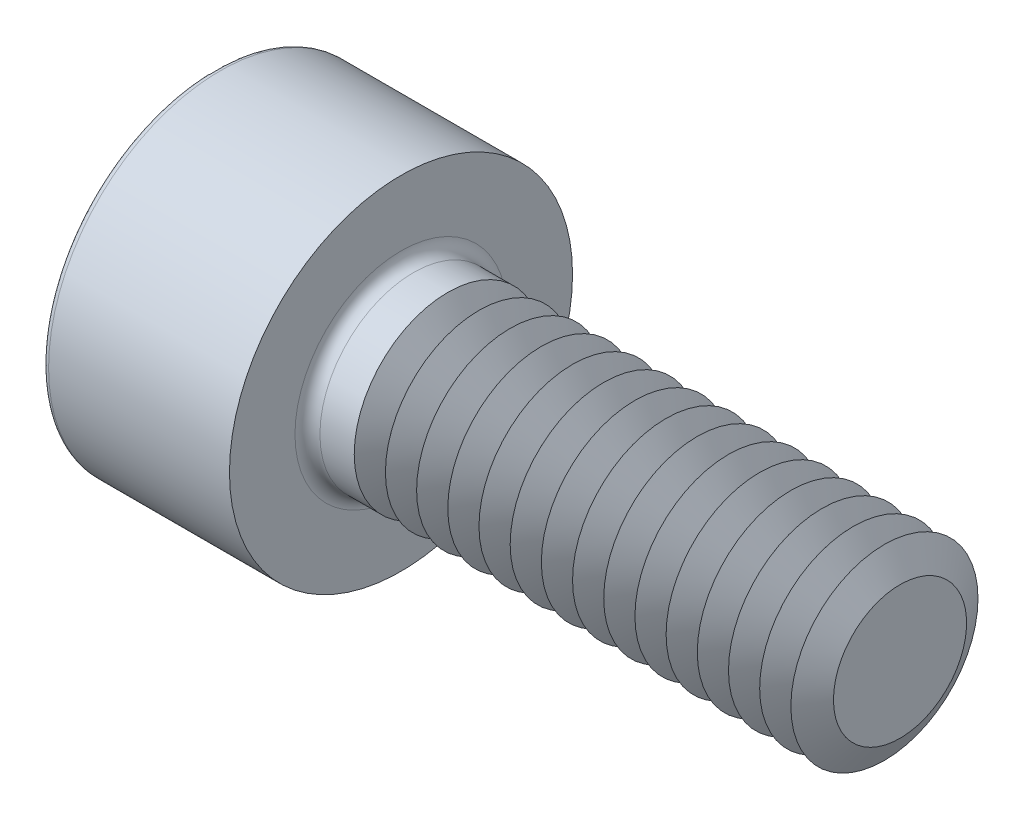
ISO-10303-21;
HEADER;
FILE_DESCRIPTION(('STEP AP214'),'2;1');
FILE_NAME('part.step','',(''),(''),'','','');
FILE_SCHEMA(('AUTOMOTIVE_DESIGN { 1 0 10303 214 1 1 1 1 }'));
ENDSEC;
DATA;
#1=APPLICATION_CONTEXT('core data for automotive mechanical design processes');
#2=APPLICATION_PROTOCOL_DEFINITION('international standard','automotive_design',2000,#1);
#3=PRODUCT_CONTEXT('',#1,'mechanical');
#4=PRODUCT('Part','Part','',(#3));
#5=PRODUCT_RELATED_PRODUCT_CATEGORY('part','',(#4));
#6=PRODUCT_DEFINITION_FORMATION('','',#4);
#7=PRODUCT_DEFINITION_CONTEXT('part definition',#1,'design');
#8=PRODUCT_DEFINITION('design','',#6,#7);
#9=PRODUCT_DEFINITION_SHAPE('','',#8);
#10=(LENGTH_UNIT() NAMED_UNIT(*) SI_UNIT(.MILLI.,.METRE.));
#11=(NAMED_UNIT(*) PLANE_ANGLE_UNIT() SI_UNIT($,.RADIAN.));
#12=(NAMED_UNIT(*) SI_UNIT($,.STERADIAN.) SOLID_ANGLE_UNIT());
#13=UNCERTAINTY_MEASURE_WITH_UNIT(LENGTH_MEASURE(1.E-05),#10,'distance_accuracy_value','');
#14=(GEOMETRIC_REPRESENTATION_CONTEXT(3) GLOBAL_UNCERTAINTY_ASSIGNED_CONTEXT((#13)) GLOBAL_UNIT_ASSIGNED_CONTEXT((#10,
#11,#12)) REPRESENTATION_CONTEXT('',''));
#15=CARTESIAN_POINT('',(0.,0.,0.));
#16=DIRECTION('',(0.,0.,1.));
#17=DIRECTION('',(1.,0.,0.));
#18=AXIS2_PLACEMENT_3D('',#15,#16,#17);
#19=CARTESIAN_POINT('',(0.,0.,0.));
#20=DIRECTION('',(-1.,0.,0.));
#21=DIRECTION('',(0.,0.,1.));
#22=AXIS2_PLACEMENT_3D('',#19,#20,#21);
#23=CYLINDRICAL_SURFACE('',#22,1.5);
#24=CARTESIAN_POINT('',(4.25000733344089,0.,0.));
#25=DIRECTION('',(-1.,0.,0.));
#26=DIRECTION('',(0.,0.,1.));
#27=AXIS2_PLACEMENT_3D('',#24,#25,#26);
#28=CIRCLE('',#27,1.5);
#29=CARTESIAN_POINT('',(4.25000733344089,0.,1.5));
#30=VERTEX_POINT('',#29);
#31=EDGE_CURVE('E347',#30,#30,#28,.T.);
#32=ORIENTED_EDGE('',*,*,#31,.T.);
#33=EDGE_LOOP('',(#32));
#34=FACE_BOUND('',#33,.T.);
#35=CARTESIAN_POINT('',(4.24999266655911,0.,0.));
#36=DIRECTION('',(-1.,0.,0.));
#37=DIRECTION('',(0.,0.,1.));
#38=AXIS2_PLACEMENT_3D('',#35,#36,#37);
#39=CIRCLE('',#38,1.5);
#40=CARTESIAN_POINT('',(4.24999266655911,0.,1.5));
#41=VERTEX_POINT('',#40);
#42=EDGE_CURVE('E343',#41,#41,#39,.T.);
#43=ORIENTED_EDGE('',*,*,#42,.F.);
#44=EDGE_LOOP('',(#43));
#45=FACE_BOUND('',#44,.T.);
#46=ADVANCED_FACE('F38',(#34,#45),#23,.T.);
#47=CARTESIAN_POINT('',(4.75000733344089,0.,0.));
#48=DIRECTION('',(-1.,0.,0.));
#49=DIRECTION('',(0.,0.,1.));
#50=AXIS2_PLACEMENT_3D('',#47,#48,#49);
#51=CIRCLE('',#50,1.5);
#52=CARTESIAN_POINT('',(4.75000733344089,0.,1.5));
#53=VERTEX_POINT('',#52);
#54=EDGE_CURVE('E360',#53,#53,#51,.T.);
#55=ORIENTED_EDGE('',*,*,#54,.T.);
#56=EDGE_LOOP('',(#55));
#57=FACE_BOUND('',#56,.T.);
#58=CARTESIAN_POINT('',(4.74999266655911,0.,0.));
#59=DIRECTION('',(-1.,0.,0.));
#60=DIRECTION('',(0.,0.,1.));
#61=AXIS2_PLACEMENT_3D('',#58,#59,#60);
#62=CIRCLE('',#61,1.5);
#63=CARTESIAN_POINT('',(4.74999266655911,0.,1.5));
#64=VERTEX_POINT('',#63);
#65=EDGE_CURVE('E349',#64,#64,#62,.T.);
#66=ORIENTED_EDGE('',*,*,#65,.F.);
#67=EDGE_LOOP('',(#66));
#68=FACE_BOUND('',#67,.T.);
#69=ADVANCED_FACE('F173',(#57,#68),#23,.T.);
#70=CARTESIAN_POINT('',(5.25000733344089,0.,0.));
#71=DIRECTION('',(-1.,0.,0.));
#72=DIRECTION('',(0.,0.,1.));
#73=AXIS2_PLACEMENT_3D('',#70,#71,#72);
#74=CIRCLE('',#73,1.5);
#75=CARTESIAN_POINT('',(5.25000733344089,0.,1.5));
#76=VERTEX_POINT('',#75);
#77=EDGE_CURVE('E369',#76,#76,#74,.T.);
#78=ORIENTED_EDGE('',*,*,#77,.T.);
#79=EDGE_LOOP('',(#78));
#80=FACE_BOUND('',#79,.T.);
#81=CARTESIAN_POINT('',(5.24999266655911,0.,0.));
#82=DIRECTION('',(-1.,0.,0.));
#83=DIRECTION('',(0.,0.,1.));
#84=AXIS2_PLACEMENT_3D('',#81,#82,#83);
#85=CIRCLE('',#84,1.5);
#86=CARTESIAN_POINT('',(5.24999266655911,0.,1.5));
#87=VERTEX_POINT('',#86);
#88=EDGE_CURVE('E363',#87,#87,#85,.T.);
#89=ORIENTED_EDGE('',*,*,#88,.F.);
#90=EDGE_LOOP('',(#89));
#91=FACE_BOUND('',#90,.T.);
#92=ADVANCED_FACE('F178',(#80,#91),#23,.T.);
#93=CARTESIAN_POINT('',(5.75000733344089,0.,0.));
#94=DIRECTION('',(-1.,0.,0.));
#95=DIRECTION('',(0.,0.,1.));
#96=AXIS2_PLACEMENT_3D('',#93,#94,#95);
#97=CIRCLE('',#96,1.5);
#98=CARTESIAN_POINT('',(5.75000733344089,0.,1.5));
#99=VERTEX_POINT('',#98);
#100=EDGE_CURVE('E378',#99,#99,#97,.T.);
#101=ORIENTED_EDGE('',*,*,#100,.T.);
#102=EDGE_LOOP('',(#101));
#103=FACE_BOUND('',#102,.T.);
#104=CARTESIAN_POINT('',(5.74999266655911,0.,0.));
#105=DIRECTION('',(-1.,0.,0.));
#106=DIRECTION('',(0.,0.,1.));
#107=AXIS2_PLACEMENT_3D('',#104,#105,#106);
#108=CIRCLE('',#107,1.5);
#109=CARTESIAN_POINT('',(5.74999266655911,0.,1.5));
#110=VERTEX_POINT('',#109);
#111=EDGE_CURVE('E372',#110,#110,#108,.T.);
#112=ORIENTED_EDGE('',*,*,#111,.F.);
#113=EDGE_LOOP('',(#112));
#114=FACE_BOUND('',#113,.T.);
#115=ADVANCED_FACE('F763',(#103,#114),#23,.T.);
#116=CARTESIAN_POINT('',(6.25000733344089,0.,0.));
#117=DIRECTION('',(-1.,0.,0.));
#118=DIRECTION('',(0.,0.,1.));
#119=AXIS2_PLACEMENT_3D('',#116,#117,#118);
#120=CIRCLE('',#119,1.5);
#121=CARTESIAN_POINT('',(6.25000733344089,0.,1.5));
#122=VERTEX_POINT('',#121);
#123=EDGE_CURVE('E387',#122,#122,#120,.T.);
#124=ORIENTED_EDGE('',*,*,#123,.T.);
#125=EDGE_LOOP('',(#124));
#126=FACE_BOUND('',#125,.T.);
#127=CARTESIAN_POINT('',(6.24999266655911,0.,0.));
#128=DIRECTION('',(-1.,0.,0.));
#129=DIRECTION('',(0.,0.,1.));
#130=AXIS2_PLACEMENT_3D('',#127,#128,#129);
#131=CIRCLE('',#130,1.5);
#132=CARTESIAN_POINT('',(6.24999266655911,0.,1.5));
#133=VERTEX_POINT('',#132);
#134=EDGE_CURVE('E381',#133,#133,#131,.T.);
#135=ORIENTED_EDGE('',*,*,#134,.F.);
#136=EDGE_LOOP('',(#135));
#137=FACE_BOUND('',#136,.T.);
#138=ADVANCED_FACE('F755',(#126,#137),#23,.T.);
#139=CARTESIAN_POINT('',(6.75000733344089,0.,0.));
#140=DIRECTION('',(-1.,0.,0.));
#141=DIRECTION('',(0.,0.,1.));
#142=AXIS2_PLACEMENT_3D('',#139,#140,#141);
#143=CIRCLE('',#142,1.5);
#144=CARTESIAN_POINT('',(6.75000733344089,0.,1.5));
#145=VERTEX_POINT('',#144);
#146=EDGE_CURVE('E396',#145,#145,#143,.T.);
#147=ORIENTED_EDGE('',*,*,#146,.T.);
#148=EDGE_LOOP('',(#147));
#149=FACE_BOUND('',#148,.T.);
#150=CARTESIAN_POINT('',(6.74999266655911,0.,0.));
#151=DIRECTION('',(-1.,0.,0.));
#152=DIRECTION('',(0.,0.,1.));
#153=AXIS2_PLACEMENT_3D('',#150,#151,#152);
#154=CIRCLE('',#153,1.5);
#155=CARTESIAN_POINT('',(6.74999266655911,0.,1.5));
#156=VERTEX_POINT('',#155);
#157=EDGE_CURVE('E390',#156,#156,#154,.T.);
#158=ORIENTED_EDGE('',*,*,#157,.F.);
#159=EDGE_LOOP('',(#158));
#160=FACE_BOUND('',#159,.T.);
#161=ADVANCED_FACE('F747',(#149,#160),#23,.T.);
#162=CARTESIAN_POINT('',(7.25000733344089,0.,0.));
#163=DIRECTION('',(-1.,0.,0.));
#164=DIRECTION('',(0.,0.,1.));
#165=AXIS2_PLACEMENT_3D('',#162,#163,#164);
#166=CIRCLE('',#165,1.5);
#167=CARTESIAN_POINT('',(7.25000733344089,0.,1.5));
#168=VERTEX_POINT('',#167);
#169=EDGE_CURVE('E405',#168,#168,#166,.T.);
#170=ORIENTED_EDGE('',*,*,#169,.T.);
#171=EDGE_LOOP('',(#170));
#172=FACE_BOUND('',#171,.T.);
#173=CARTESIAN_POINT('',(7.24999266655911,0.,0.));
#174=DIRECTION('',(-1.,0.,0.));
#175=DIRECTION('',(0.,0.,1.));
#176=AXIS2_PLACEMENT_3D('',#173,#174,#175);
#177=CIRCLE('',#176,1.5);
#178=CARTESIAN_POINT('',(7.24999266655911,0.,1.5));
#179=VERTEX_POINT('',#178);
#180=EDGE_CURVE('E399',#179,#179,#177,.T.);
#181=ORIENTED_EDGE('',*,*,#180,.F.);
#182=EDGE_LOOP('',(#181));
#183=FACE_BOUND('',#182,.T.);
#184=ADVANCED_FACE('F739',(#172,#183),#23,.T.);
#185=CARTESIAN_POINT('',(7.75000733344089,0.,0.));
#186=DIRECTION('',(-1.,0.,0.));
#187=DIRECTION('',(0.,0.,1.));
#188=AXIS2_PLACEMENT_3D('',#185,#186,#187);
#189=CIRCLE('',#188,1.5);
#190=CARTESIAN_POINT('',(7.75000733344089,0.,1.5));
#191=VERTEX_POINT('',#190);
#192=EDGE_CURVE('E414',#191,#191,#189,.T.);
#193=ORIENTED_EDGE('',*,*,#192,.T.);
#194=EDGE_LOOP('',(#193));
#195=FACE_BOUND('',#194,.T.);
#196=CARTESIAN_POINT('',(7.74999266655911,0.,0.));
#197=DIRECTION('',(-1.,0.,0.));
#198=DIRECTION('',(0.,0.,1.));
#199=AXIS2_PLACEMENT_3D('',#196,#197,#198);
#200=CIRCLE('',#199,1.5);
#201=CARTESIAN_POINT('',(7.74999266655911,0.,1.5));
#202=VERTEX_POINT('',#201);
#203=EDGE_CURVE('E408',#202,#202,#200,.T.);
#204=ORIENTED_EDGE('',*,*,#203,.F.);
#205=EDGE_LOOP('',(#204));
#206=FACE_BOUND('',#205,.T.);
#207=ADVANCED_FACE('F731',(#195,#206),#23,.T.);
#208=CARTESIAN_POINT('',(8.25000733344089,0.,0.));
#209=DIRECTION('',(-1.,0.,0.));
#210=DIRECTION('',(0.,0.,1.));
#211=AXIS2_PLACEMENT_3D('',#208,#209,#210);
#212=CIRCLE('',#211,1.5);
#213=CARTESIAN_POINT('',(8.25000733344089,0.,1.5));
#214=VERTEX_POINT('',#213);
#215=EDGE_CURVE('E423',#214,#214,#212,.T.);
#216=ORIENTED_EDGE('',*,*,#215,.T.);
#217=EDGE_LOOP('',(#216));
#218=FACE_BOUND('',#217,.T.);
#219=CARTESIAN_POINT('',(8.24999266655911,0.,0.));
#220=DIRECTION('',(-1.,0.,0.));
#221=DIRECTION('',(0.,0.,1.));
#222=AXIS2_PLACEMENT_3D('',#219,#220,#221);
#223=CIRCLE('',#222,1.5);
#224=CARTESIAN_POINT('',(8.24999266655911,0.,1.5));
#225=VERTEX_POINT('',#224);
#226=EDGE_CURVE('E417',#225,#225,#223,.T.);
#227=ORIENTED_EDGE('',*,*,#226,.F.);
#228=EDGE_LOOP('',(#227));
#229=FACE_BOUND('',#228,.T.);
#230=ADVANCED_FACE('F723',(#218,#229),#23,.T.);
#231=CARTESIAN_POINT('',(8.75000733344089,0.,0.));
#232=DIRECTION('',(-1.,0.,0.));
#233=DIRECTION('',(0.,0.,1.));
#234=AXIS2_PLACEMENT_3D('',#231,#232,#233);
#235=CIRCLE('',#234,1.5);
#236=CARTESIAN_POINT('',(8.75000733344089,0.,1.5));
#237=VERTEX_POINT('',#236);
#238=EDGE_CURVE('E432',#237,#237,#235,.T.);
#239=ORIENTED_EDGE('',*,*,#238,.T.);
#240=EDGE_LOOP('',(#239));
#241=FACE_BOUND('',#240,.T.);
#242=CARTESIAN_POINT('',(8.74999266655911,0.,0.));
#243=DIRECTION('',(-1.,0.,0.));
#244=DIRECTION('',(0.,0.,1.));
#245=AXIS2_PLACEMENT_3D('',#242,#243,#244);
#246=CIRCLE('',#245,1.5);
#247=CARTESIAN_POINT('',(8.74999266655911,0.,1.5));
#248=VERTEX_POINT('',#247);
#249=EDGE_CURVE('E426',#248,#248,#246,.T.);
#250=ORIENTED_EDGE('',*,*,#249,.F.);
#251=EDGE_LOOP('',(#250));
#252=FACE_BOUND('',#251,.T.);
#253=ADVANCED_FACE('F715',(#241,#252),#23,.T.);
#254=CARTESIAN_POINT('',(9.25000733344089,0.,0.));
#255=DIRECTION('',(-1.,0.,0.));
#256=DIRECTION('',(0.,0.,1.));
#257=AXIS2_PLACEMENT_3D('',#254,#255,#256);
#258=CIRCLE('',#257,1.5);
#259=CARTESIAN_POINT('',(9.25000733344089,0.,1.5));
#260=VERTEX_POINT('',#259);
#261=EDGE_CURVE('E441',#260,#260,#258,.T.);
#262=ORIENTED_EDGE('',*,*,#261,.T.);
#263=EDGE_LOOP('',(#262));
#264=FACE_BOUND('',#263,.T.);
#265=CARTESIAN_POINT('',(9.24999266655911,0.,0.));
#266=DIRECTION('',(-1.,0.,0.));
#267=DIRECTION('',(0.,0.,1.));
#268=AXIS2_PLACEMENT_3D('',#265,#266,#267);
#269=CIRCLE('',#268,1.5);
#270=CARTESIAN_POINT('',(9.24999266655911,0.,1.5));
#271=VERTEX_POINT('',#270);
#272=EDGE_CURVE('E435',#271,#271,#269,.T.);
#273=ORIENTED_EDGE('',*,*,#272,.F.);
#274=EDGE_LOOP('',(#273));
#275=FACE_BOUND('',#274,.T.);
#276=ADVANCED_FACE('F706',(#264,#275),#23,.T.);
#277=CARTESIAN_POINT('',(9.75000733344089,0.,0.));
#278=DIRECTION('',(-1.,0.,0.));
#279=DIRECTION('',(0.,0.,1.));
#280=AXIS2_PLACEMENT_3D('',#277,#278,#279);
#281=CIRCLE('',#280,1.5);
#282=CARTESIAN_POINT('',(9.75000733344089,0.,1.5));
#283=VERTEX_POINT('',#282);
#284=EDGE_CURVE('E450',#283,#283,#281,.T.);
#285=ORIENTED_EDGE('',*,*,#284,.T.);
#286=EDGE_LOOP('',(#285));
#287=FACE_BOUND('',#286,.T.);
#288=CARTESIAN_POINT('',(9.74999266655911,0.,0.));
#289=DIRECTION('',(-1.,0.,0.));
#290=DIRECTION('',(0.,0.,1.));
#291=AXIS2_PLACEMENT_3D('',#288,#289,#290);
#292=CIRCLE('',#291,1.5);
#293=CARTESIAN_POINT('',(9.74999266655911,0.,1.5));
#294=VERTEX_POINT('',#293);
#295=EDGE_CURVE('E444',#294,#294,#292,.T.);
#296=ORIENTED_EDGE('',*,*,#295,.F.);
#297=EDGE_LOOP('',(#296));
#298=FACE_BOUND('',#297,.T.);
#299=ADVANCED_FACE('F239',(#287,#298),#23,.T.);
#300=CARTESIAN_POINT('',(9.75000733344089,0.,0.));
#301=DIRECTION('',(-1.,0.,0.));
#302=DIRECTION('',(0.,0.,1.));
#303=AXIS2_PLACEMENT_3D('',#300,#301,#302);
#304=CONICAL_SURFACE('',#303,1.5,1.0471975511966);
#305=CARTESIAN_POINT('',(10.,0.,0.));
#306=DIRECTION('',(-1.,0.,0.));
#307=DIRECTION('',(0.,0.,1.));
#308=AXIS2_PLACEMENT_3D('',#305,#306,#307);
#309=CIRCLE('',#308,1.067);
#310=CARTESIAN_POINT('',(10.,0.,1.067));
#311=VERTEX_POINT('',#310);
#312=EDGE_CURVE('E456',#311,#311,#309,.T.);
#313=ORIENTED_EDGE('',*,*,#312,.T.);
#314=EDGE_LOOP('',(#313));
#315=FACE_BOUND('',#314,.T.);
#316=ORIENTED_EDGE('',*,*,#284,.F.);
#317=EDGE_LOOP('',(#316));
#318=FACE_BOUND('',#317,.T.);
#319=ADVANCED_FACE('F235',(#315,#318),#304,.T.);
#320=CARTESIAN_POINT('',(10.,0.,0.));
#321=DIRECTION('',(1.,0.,0.));
#322=DIRECTION('',(0.,0.,-1.));
#323=AXIS2_PLACEMENT_3D('',#320,#321,#322);
#324=CONICAL_SURFACE('',#323,1.067,1.0471975511966);
#325=CARTESIAN_POINT('',(10.2499926665591,0.,0.));
#326=DIRECTION('',(-1.,0.,0.));
#327=DIRECTION('',(0.,0.,1.));
#328=AXIS2_PLACEMENT_3D('',#325,#326,#327);
#329=CIRCLE('',#328,1.5);
#330=CARTESIAN_POINT('',(10.2499926665591,0.,1.5));
#331=VERTEX_POINT('',#330);
#332=EDGE_CURVE('E453',#331,#331,#329,.T.);
#333=ORIENTED_EDGE('',*,*,#332,.T.);
#334=EDGE_LOOP('',(#333));
#335=FACE_BOUND('',#334,.T.);
#336=ORIENTED_EDGE('',*,*,#312,.F.);
#337=EDGE_LOOP('',(#336));
#338=FACE_BOUND('',#337,.T.);
#339=ADVANCED_FACE('F238',(#335,#338),#324,.T.);
#340=CARTESIAN_POINT('',(11.,1.5,0.));
#341=DIRECTION('',(-1.,0.,0.));
#342=DIRECTION('',(0.,0.,1.));
#343=AXIS2_PLACEMENT_3D('',#340,#341,#342);
#344=PLANE('',#343);
#345=CARTESIAN_POINT('',(11.,0.,0.));
#346=DIRECTION('',(-1.,0.,0.));
#347=DIRECTION('',(0.,0.,1.));
#348=AXIS2_PLACEMENT_3D('',#345,#346,#347);
#349=CIRCLE('',#348,1.067);
#350=CARTESIAN_POINT('',(11.,0.,1.067));
#351=VERTEX_POINT('',#350);
#352=EDGE_CURVE('E128',#351,#351,#349,.T.);
#353=ORIENTED_EDGE('',*,*,#352,.F.);
#354=EDGE_LOOP('',(#353));
#355=FACE_BOUND('',#354,.T.);
#356=ADVANCED_FACE('F184',(#355),#344,.F.);
#357=CARTESIAN_POINT('',(10.7500073334409,0.,0.));
#358=DIRECTION('',(-1.,0.,0.));
#359=DIRECTION('',(0.,0.,1.));
#360=AXIS2_PLACEMENT_3D('',#357,#358,#359);
#361=CONICAL_SURFACE('',#360,1.5,1.0471975511966);
#362=ORIENTED_EDGE('',*,*,#352,.T.);
#363=EDGE_LOOP('',(#362));
#364=FACE_BOUND('',#363,.T.);
#365=CARTESIAN_POINT('',(10.7500073334409,0.,0.));
#366=DIRECTION('',(-1.,0.,0.));
#367=DIRECTION('',(0.,0.,1.));
#368=AXIS2_PLACEMENT_3D('',#365,#366,#367);
#369=CIRCLE('',#368,1.5);
#370=CARTESIAN_POINT('',(10.7500073334409,0.,1.5));
#371=VERTEX_POINT('',#370);
#372=EDGE_CURVE('E468',#371,#371,#369,.T.);
#373=ORIENTED_EDGE('',*,*,#372,.F.);
#374=EDGE_LOOP('',(#373));
#375=FACE_BOUND('',#374,.T.);
#376=ADVANCED_FACE('F222',(#364,#375),#361,.T.);
#377=ORIENTED_EDGE('',*,*,#372,.T.);
#378=EDGE_LOOP('',(#377));
#379=FACE_BOUND('',#378,.T.);
#380=CARTESIAN_POINT('',(10.7499926665591,0.,0.));
#381=DIRECTION('',(-1.,0.,0.));
#382=DIRECTION('',(0.,0.,1.));
#383=AXIS2_PLACEMENT_3D('',#380,#381,#382);
#384=CIRCLE('',#383,1.5);
#385=CARTESIAN_POINT('',(10.7499926665591,0.,1.5));
#386=VERTEX_POINT('',#385);
#387=EDGE_CURVE('E462',#386,#386,#384,.T.);
#388=ORIENTED_EDGE('',*,*,#387,.F.);
#389=EDGE_LOOP('',(#388));
#390=FACE_BOUND('',#389,.T.);
#391=ADVANCED_FACE('F170',(#379,#390),#23,.T.);
#392=CARTESIAN_POINT('',(10.5,0.,0.));
#393=DIRECTION('',(1.,0.,0.));
#394=DIRECTION('',(0.,0.,-1.));
#395=AXIS2_PLACEMENT_3D('',#392,#393,#394);
#396=CONICAL_SURFACE('',#395,1.067,1.0471975511966);
#397=ORIENTED_EDGE('',*,*,#387,.T.);
#398=EDGE_LOOP('',(#397));
#399=FACE_BOUND('',#398,.T.);
#400=CARTESIAN_POINT('',(10.5,0.,0.));
#401=DIRECTION('',(-1.,0.,0.));
#402=DIRECTION('',(0.,0.,1.));
#403=AXIS2_PLACEMENT_3D('',#400,#401,#402);
#404=CIRCLE('',#403,1.067);
#405=CARTESIAN_POINT('',(10.5,0.,1.067));
#406=VERTEX_POINT('',#405);
#407=EDGE_CURVE('E465',#406,#406,#404,.T.);
#408=ORIENTED_EDGE('',*,*,#407,.F.);
#409=EDGE_LOOP('',(#408));
#410=FACE_BOUND('',#409,.T.);
#411=ADVANCED_FACE('F230',(#399,#410),#396,.T.);
#412=CARTESIAN_POINT('',(10.2500073334409,0.,0.));
#413=DIRECTION('',(-1.,0.,0.));
#414=DIRECTION('',(0.,0.,1.));
#415=AXIS2_PLACEMENT_3D('',#412,#413,#414);
#416=CONICAL_SURFACE('',#415,1.5,1.0471975511966);
#417=ORIENTED_EDGE('',*,*,#407,.T.);
#418=EDGE_LOOP('',(#417));
#419=FACE_BOUND('',#418,.T.);
#420=CARTESIAN_POINT('',(10.2500073334409,0.,0.));
#421=DIRECTION('',(-1.,0.,0.));
#422=DIRECTION('',(0.,0.,1.));
#423=AXIS2_PLACEMENT_3D('',#420,#421,#422);
#424=CIRCLE('',#423,1.5);
#425=CARTESIAN_POINT('',(10.2500073334409,0.,1.5));
#426=VERTEX_POINT('',#425);
#427=EDGE_CURVE('E459',#426,#426,#424,.T.);
#428=ORIENTED_EDGE('',*,*,#427,.F.);
#429=EDGE_LOOP('',(#428));
#430=FACE_BOUND('',#429,.T.);
#431=ADVANCED_FACE('F226',(#419,#430),#416,.T.);
#432=ORIENTED_EDGE('',*,*,#427,.T.);
#433=EDGE_LOOP('',(#432));
#434=FACE_BOUND('',#433,.T.);
#435=ORIENTED_EDGE('',*,*,#332,.F.);
#436=EDGE_LOOP('',(#435));
#437=FACE_BOUND('',#436,.T.);
#438=ADVANCED_FACE('F229',(#434,#437),#23,.T.);
#439=CARTESIAN_POINT('',(9.25000733344089,0.,0.));
#440=DIRECTION('',(-1.,0.,0.));
#441=DIRECTION('',(0.,0.,1.));
#442=AXIS2_PLACEMENT_3D('',#439,#440,#441);
#443=CONICAL_SURFACE('',#442,1.5,1.0471975511966);
#444=CARTESIAN_POINT('',(9.5,0.,0.));
#445=DIRECTION('',(-1.,0.,0.));
#446=DIRECTION('',(0.,0.,1.));
#447=AXIS2_PLACEMENT_3D('',#444,#445,#446);
#448=CIRCLE('',#447,1.067);
#449=CARTESIAN_POINT('',(9.5,0.,1.067));
#450=VERTEX_POINT('',#449);
#451=EDGE_CURVE('E447',#450,#450,#448,.T.);
#452=ORIENTED_EDGE('',*,*,#451,.T.);
#453=EDGE_LOOP('',(#452));
#454=FACE_BOUND('',#453,.T.);
#455=ORIENTED_EDGE('',*,*,#261,.F.);
#456=EDGE_LOOP('',(#455));
#457=FACE_BOUND('',#456,.T.);
#458=ADVANCED_FACE('F244',(#454,#457),#443,.T.);
#459=CARTESIAN_POINT('',(9.5,0.,0.));
#460=DIRECTION('',(1.,0.,0.));
#461=DIRECTION('',(0.,0.,-1.));
#462=AXIS2_PLACEMENT_3D('',#459,#460,#461);
#463=CONICAL_SURFACE('',#462,1.067,1.0471975511966);
#464=ORIENTED_EDGE('',*,*,#295,.T.);
#465=EDGE_LOOP('',(#464));
#466=FACE_BOUND('',#465,.T.);
#467=ORIENTED_EDGE('',*,*,#451,.F.);
#468=EDGE_LOOP('',(#467));
#469=FACE_BOUND('',#468,.T.);
#470=ADVANCED_FACE('F247',(#466,#469),#463,.T.);
#471=CARTESIAN_POINT('',(8.75000733344089,0.,0.));
#472=DIRECTION('',(-1.,0.,0.));
#473=DIRECTION('',(0.,0.,1.));
#474=AXIS2_PLACEMENT_3D('',#471,#472,#473);
#475=CONICAL_SURFACE('',#474,1.5,1.0471975511966);
#476=CARTESIAN_POINT('',(9.,0.,0.));
#477=DIRECTION('',(-1.,0.,0.));
#478=DIRECTION('',(0.,0.,1.));
#479=AXIS2_PLACEMENT_3D('',#476,#477,#478);
#480=CIRCLE('',#479,1.067);
#481=CARTESIAN_POINT('',(9.,0.,1.067));
#482=VERTEX_POINT('',#481);
#483=EDGE_CURVE('E438',#482,#482,#480,.T.);
#484=ORIENTED_EDGE('',*,*,#483,.T.);
#485=EDGE_LOOP('',(#484));
#486=FACE_BOUND('',#485,.T.);
#487=ORIENTED_EDGE('',*,*,#238,.F.);
#488=EDGE_LOOP('',(#487));
#489=FACE_BOUND('',#488,.T.);
#490=ADVANCED_FACE('F251',(#486,#489),#475,.T.);
#491=CARTESIAN_POINT('',(9.,0.,0.));
#492=DIRECTION('',(1.,0.,0.));
#493=DIRECTION('',(0.,0.,-1.));
#494=AXIS2_PLACEMENT_3D('',#491,#492,#493);
#495=CONICAL_SURFACE('',#494,1.067,1.0471975511966);
#496=ORIENTED_EDGE('',*,*,#272,.T.);
#497=EDGE_LOOP('',(#496));
#498=FACE_BOUND('',#497,.T.);
#499=ORIENTED_EDGE('',*,*,#483,.F.);
#500=EDGE_LOOP('',(#499));
#501=FACE_BOUND('',#500,.T.);
#502=ADVANCED_FACE('F255',(#498,#501),#495,.T.);
#503=CARTESIAN_POINT('',(8.25000733344089,0.,0.));
#504=DIRECTION('',(-1.,0.,0.));
#505=DIRECTION('',(0.,0.,1.));
#506=AXIS2_PLACEMENT_3D('',#503,#504,#505);
#507=CONICAL_SURFACE('',#506,1.5,1.0471975511966);
#508=CARTESIAN_POINT('',(8.5,0.,0.));
#509=DIRECTION('',(-1.,0.,0.));
#510=DIRECTION('',(0.,0.,1.));
#511=AXIS2_PLACEMENT_3D('',#508,#509,#510);
#512=CIRCLE('',#511,1.067);
#513=CARTESIAN_POINT('',(8.5,0.,1.067));
#514=VERTEX_POINT('',#513);
#515=EDGE_CURVE('E429',#514,#514,#512,.T.);
#516=ORIENTED_EDGE('',*,*,#515,.T.);
#517=EDGE_LOOP('',(#516));
#518=FACE_BOUND('',#517,.T.);
#519=ORIENTED_EDGE('',*,*,#215,.F.);
#520=EDGE_LOOP('',(#519));
#521=FACE_BOUND('',#520,.T.);
#522=ADVANCED_FACE('F259',(#518,#521),#507,.T.);
#523=CARTESIAN_POINT('',(8.5,0.,0.));
#524=DIRECTION('',(1.,0.,0.));
#525=DIRECTION('',(0.,0.,-1.));
#526=AXIS2_PLACEMENT_3D('',#523,#524,#525);
#527=CONICAL_SURFACE('',#526,1.067,1.0471975511966);
#528=ORIENTED_EDGE('',*,*,#249,.T.);
#529=EDGE_LOOP('',(#528));
#530=FACE_BOUND('',#529,.T.);
#531=ORIENTED_EDGE('',*,*,#515,.F.);
#532=EDGE_LOOP('',(#531));
#533=FACE_BOUND('',#532,.T.);
#534=ADVANCED_FACE('F263',(#530,#533),#527,.T.);
#535=CARTESIAN_POINT('',(7.75000733344089,0.,0.));
#536=DIRECTION('',(-1.,0.,0.));
#537=DIRECTION('',(0.,0.,1.));
#538=AXIS2_PLACEMENT_3D('',#535,#536,#537);
#539=CONICAL_SURFACE('',#538,1.5,1.0471975511966);
#540=CARTESIAN_POINT('',(8.,0.,0.));
#541=DIRECTION('',(-1.,0.,0.));
#542=DIRECTION('',(0.,0.,1.));
#543=AXIS2_PLACEMENT_3D('',#540,#541,#542);
#544=CIRCLE('',#543,1.067);
#545=CARTESIAN_POINT('',(8.,0.,1.067));
#546=VERTEX_POINT('',#545);
#547=EDGE_CURVE('E420',#546,#546,#544,.T.);
#548=ORIENTED_EDGE('',*,*,#547,.T.);
#549=EDGE_LOOP('',(#548));
#550=FACE_BOUND('',#549,.T.);
#551=ORIENTED_EDGE('',*,*,#192,.F.);
#552=EDGE_LOOP('',(#551));
#553=FACE_BOUND('',#552,.T.);
#554=ADVANCED_FACE('F267',(#550,#553),#539,.T.);
#555=CARTESIAN_POINT('',(8.,0.,0.));
#556=DIRECTION('',(1.,0.,0.));
#557=DIRECTION('',(0.,0.,-1.));
#558=AXIS2_PLACEMENT_3D('',#555,#556,#557);
#559=CONICAL_SURFACE('',#558,1.067,1.0471975511966);
#560=ORIENTED_EDGE('',*,*,#226,.T.);
#561=EDGE_LOOP('',(#560));
#562=FACE_BOUND('',#561,.T.);
#563=ORIENTED_EDGE('',*,*,#547,.F.);
#564=EDGE_LOOP('',(#563));
#565=FACE_BOUND('',#564,.T.);
#566=ADVANCED_FACE('F271',(#562,#565),#559,.T.);
#567=CARTESIAN_POINT('',(7.25000733344089,0.,0.));
#568=DIRECTION('',(-1.,0.,0.));
#569=DIRECTION('',(0.,0.,1.));
#570=AXIS2_PLACEMENT_3D('',#567,#568,#569);
#571=CONICAL_SURFACE('',#570,1.5,1.0471975511966);
#572=CARTESIAN_POINT('',(7.5,0.,0.));
#573=DIRECTION('',(-1.,0.,0.));
#574=DIRECTION('',(0.,0.,1.));
#575=AXIS2_PLACEMENT_3D('',#572,#573,#574);
#576=CIRCLE('',#575,1.067);
#577=CARTESIAN_POINT('',(7.5,0.,1.067));
#578=VERTEX_POINT('',#577);
#579=EDGE_CURVE('E411',#578,#578,#576,.T.);
#580=ORIENTED_EDGE('',*,*,#579,.T.);
#581=EDGE_LOOP('',(#580));
#582=FACE_BOUND('',#581,.T.);
#583=ORIENTED_EDGE('',*,*,#169,.F.);
#584=EDGE_LOOP('',(#583));
#585=FACE_BOUND('',#584,.T.);
#586=ADVANCED_FACE('F275',(#582,#585),#571,.T.);
#587=CARTESIAN_POINT('',(7.5,0.,0.));
#588=DIRECTION('',(1.,0.,0.));
#589=DIRECTION('',(0.,0.,-1.));
#590=AXIS2_PLACEMENT_3D('',#587,#588,#589);
#591=CONICAL_SURFACE('',#590,1.067,1.0471975511966);
#592=ORIENTED_EDGE('',*,*,#203,.T.);
#593=EDGE_LOOP('',(#592));
#594=FACE_BOUND('',#593,.T.);
#595=ORIENTED_EDGE('',*,*,#579,.F.);
#596=EDGE_LOOP('',(#595));
#597=FACE_BOUND('',#596,.T.);
#598=ADVANCED_FACE('F279',(#594,#597),#591,.T.);
#599=CARTESIAN_POINT('',(6.75000733344089,0.,0.));
#600=DIRECTION('',(-1.,0.,0.));
#601=DIRECTION('',(0.,0.,1.));
#602=AXIS2_PLACEMENT_3D('',#599,#600,#601);
#603=CONICAL_SURFACE('',#602,1.5,1.0471975511966);
#604=CARTESIAN_POINT('',(7.,0.,0.));
#605=DIRECTION('',(-1.,0.,0.));
#606=DIRECTION('',(0.,0.,1.));
#607=AXIS2_PLACEMENT_3D('',#604,#605,#606);
#608=CIRCLE('',#607,1.067);
#609=CARTESIAN_POINT('',(7.,0.,1.067));
#610=VERTEX_POINT('',#609);
#611=EDGE_CURVE('E402',#610,#610,#608,.T.);
#612=ORIENTED_EDGE('',*,*,#611,.T.);
#613=EDGE_LOOP('',(#612));
#614=FACE_BOUND('',#613,.T.);
#615=ORIENTED_EDGE('',*,*,#146,.F.);
#616=EDGE_LOOP('',(#615));
#617=FACE_BOUND('',#616,.T.);
#618=ADVANCED_FACE('F283',(#614,#617),#603,.T.);
#619=CARTESIAN_POINT('',(7.,0.,0.));
#620=DIRECTION('',(1.,0.,0.));
#621=DIRECTION('',(0.,0.,-1.));
#622=AXIS2_PLACEMENT_3D('',#619,#620,#621);
#623=CONICAL_SURFACE('',#622,1.067,1.0471975511966);
#624=ORIENTED_EDGE('',*,*,#180,.T.);
#625=EDGE_LOOP('',(#624));
#626=FACE_BOUND('',#625,.T.);
#627=ORIENTED_EDGE('',*,*,#611,.F.);
#628=EDGE_LOOP('',(#627));
#629=FACE_BOUND('',#628,.T.);
#630=ADVANCED_FACE('F287',(#626,#629),#623,.T.);
#631=CARTESIAN_POINT('',(6.25000733344089,0.,0.));
#632=DIRECTION('',(-1.,0.,0.));
#633=DIRECTION('',(0.,0.,1.));
#634=AXIS2_PLACEMENT_3D('',#631,#632,#633);
#635=CONICAL_SURFACE('',#634,1.5,1.0471975511966);
#636=CARTESIAN_POINT('',(6.5,0.,0.));
#637=DIRECTION('',(-1.,0.,0.));
#638=DIRECTION('',(0.,0.,1.));
#639=AXIS2_PLACEMENT_3D('',#636,#637,#638);
#640=CIRCLE('',#639,1.067);
#641=CARTESIAN_POINT('',(6.5,0.,1.067));
#642=VERTEX_POINT('',#641);
#643=EDGE_CURVE('E393',#642,#642,#640,.T.);
#644=ORIENTED_EDGE('',*,*,#643,.T.);
#645=EDGE_LOOP('',(#644));
#646=FACE_BOUND('',#645,.T.);
#647=ORIENTED_EDGE('',*,*,#123,.F.);
#648=EDGE_LOOP('',(#647));
#649=FACE_BOUND('',#648,.T.);
#650=ADVANCED_FACE('F291',(#646,#649),#635,.T.);
#651=CARTESIAN_POINT('',(6.5,0.,0.));
#652=DIRECTION('',(1.,0.,0.));
#653=DIRECTION('',(0.,0.,-1.));
#654=AXIS2_PLACEMENT_3D('',#651,#652,#653);
#655=CONICAL_SURFACE('',#654,1.067,1.0471975511966);
#656=ORIENTED_EDGE('',*,*,#157,.T.);
#657=EDGE_LOOP('',(#656));
#658=FACE_BOUND('',#657,.T.);
#659=ORIENTED_EDGE('',*,*,#643,.F.);
#660=EDGE_LOOP('',(#659));
#661=FACE_BOUND('',#660,.T.);
#662=ADVANCED_FACE('F295',(#658,#661),#655,.T.);
#663=CARTESIAN_POINT('',(5.75000733344089,0.,0.));
#664=DIRECTION('',(-1.,0.,0.));
#665=DIRECTION('',(0.,0.,1.));
#666=AXIS2_PLACEMENT_3D('',#663,#664,#665);
#667=CONICAL_SURFACE('',#666,1.5,1.0471975511966);
#668=CARTESIAN_POINT('',(6.,0.,0.));
#669=DIRECTION('',(-1.,0.,0.));
#670=DIRECTION('',(0.,0.,1.));
#671=AXIS2_PLACEMENT_3D('',#668,#669,#670);
#672=CIRCLE('',#671,1.067);
#673=CARTESIAN_POINT('',(6.,0.,1.067));
#674=VERTEX_POINT('',#673);
#675=EDGE_CURVE('E384',#674,#674,#672,.T.);
#676=ORIENTED_EDGE('',*,*,#675,.T.);
#677=EDGE_LOOP('',(#676));
#678=FACE_BOUND('',#677,.T.);
#679=ORIENTED_EDGE('',*,*,#100,.F.);
#680=EDGE_LOOP('',(#679));
#681=FACE_BOUND('',#680,.T.);
#682=ADVANCED_FACE('F299',(#678,#681),#667,.T.);
#683=CARTESIAN_POINT('',(6.,0.,0.));
#684=DIRECTION('',(1.,0.,0.));
#685=DIRECTION('',(0.,0.,-1.));
#686=AXIS2_PLACEMENT_3D('',#683,#684,#685);
#687=CONICAL_SURFACE('',#686,1.067,1.0471975511966);
#688=ORIENTED_EDGE('',*,*,#134,.T.);
#689=EDGE_LOOP('',(#688));
#690=FACE_BOUND('',#689,.T.);
#691=ORIENTED_EDGE('',*,*,#675,.F.);
#692=EDGE_LOOP('',(#691));
#693=FACE_BOUND('',#692,.T.);
#694=ADVANCED_FACE('F303',(#690,#693),#687,.T.);
#695=CARTESIAN_POINT('',(5.25000733344089,0.,0.));
#696=DIRECTION('',(-1.,0.,0.));
#697=DIRECTION('',(0.,0.,1.));
#698=AXIS2_PLACEMENT_3D('',#695,#696,#697);
#699=CONICAL_SURFACE('',#698,1.5,1.0471975511966);
#700=CARTESIAN_POINT('',(5.5,0.,0.));
#701=DIRECTION('',(-1.,0.,0.));
#702=DIRECTION('',(0.,0.,1.));
#703=AXIS2_PLACEMENT_3D('',#700,#701,#702);
#704=CIRCLE('',#703,1.067);
#705=CARTESIAN_POINT('',(5.5,0.,1.067));
#706=VERTEX_POINT('',#705);
#707=EDGE_CURVE('E375',#706,#706,#704,.T.);
#708=ORIENTED_EDGE('',*,*,#707,.T.);
#709=EDGE_LOOP('',(#708));
#710=FACE_BOUND('',#709,.T.);
#711=ORIENTED_EDGE('',*,*,#77,.F.);
#712=EDGE_LOOP('',(#711));
#713=FACE_BOUND('',#712,.T.);
#714=ADVANCED_FACE('F307',(#710,#713),#699,.T.);
#715=CARTESIAN_POINT('',(5.5,0.,0.));
#716=DIRECTION('',(1.,0.,0.));
#717=DIRECTION('',(0.,0.,-1.));
#718=AXIS2_PLACEMENT_3D('',#715,#716,#717);
#719=CONICAL_SURFACE('',#718,1.067,1.0471975511966);
#720=ORIENTED_EDGE('',*,*,#111,.T.);
#721=EDGE_LOOP('',(#720));
#722=FACE_BOUND('',#721,.T.);
#723=ORIENTED_EDGE('',*,*,#707,.F.);
#724=EDGE_LOOP('',(#723));
#725=FACE_BOUND('',#724,.T.);
#726=ADVANCED_FACE('F311',(#722,#725),#719,.T.);
#727=CARTESIAN_POINT('',(4.75000733344089,0.,0.));
#728=DIRECTION('',(-1.,0.,0.));
#729=DIRECTION('',(0.,0.,1.));
#730=AXIS2_PLACEMENT_3D('',#727,#728,#729);
#731=CONICAL_SURFACE('',#730,1.5,1.0471975511966);
#732=CARTESIAN_POINT('',(5.,0.,0.));
#733=DIRECTION('',(-1.,0.,0.));
#734=DIRECTION('',(0.,0.,1.));
#735=AXIS2_PLACEMENT_3D('',#732,#733,#734);
#736=CIRCLE('',#735,1.067);
#737=CARTESIAN_POINT('',(5.,0.,1.067));
#738=VERTEX_POINT('',#737);
#739=EDGE_CURVE('E366',#738,#738,#736,.T.);
#740=ORIENTED_EDGE('',*,*,#739,.T.);
#741=EDGE_LOOP('',(#740));
#742=FACE_BOUND('',#741,.T.);
#743=ORIENTED_EDGE('',*,*,#54,.F.);
#744=EDGE_LOOP('',(#743));
#745=FACE_BOUND('',#744,.T.);
#746=ADVANCED_FACE('F315',(#742,#745),#731,.T.);
#747=CARTESIAN_POINT('',(5.,0.,0.));
#748=DIRECTION('',(1.,0.,0.));
#749=DIRECTION('',(0.,0.,-1.));
#750=AXIS2_PLACEMENT_3D('',#747,#748,#749);
#751=CONICAL_SURFACE('',#750,1.067,1.0471975511966);
#752=ORIENTED_EDGE('',*,*,#88,.T.);
#753=EDGE_LOOP('',(#752));
#754=FACE_BOUND('',#753,.T.);
#755=ORIENTED_EDGE('',*,*,#739,.F.);
#756=EDGE_LOOP('',(#755));
#757=FACE_BOUND('',#756,.T.);
#758=ADVANCED_FACE('F319',(#754,#757),#751,.T.);
#759=CARTESIAN_POINT('',(4.25000733344089,0.,0.));
#760=DIRECTION('',(-1.,0.,0.));
#761=DIRECTION('',(0.,0.,1.));
#762=AXIS2_PLACEMENT_3D('',#759,#760,#761);
#763=CONICAL_SURFACE('',#762,1.5,1.0471975511966);
#764=CARTESIAN_POINT('',(4.5,0.,0.));
#765=DIRECTION('',(-1.,0.,0.));
#766=DIRECTION('',(0.,0.,1.));
#767=AXIS2_PLACEMENT_3D('',#764,#765,#766);
#768=CIRCLE('',#767,1.067);
#769=CARTESIAN_POINT('',(4.5,0.,1.067));
#770=VERTEX_POINT('',#769);
#771=EDGE_CURVE('E357',#770,#770,#768,.T.);
#772=ORIENTED_EDGE('',*,*,#771,.T.);
#773=EDGE_LOOP('',(#772));
#774=FACE_BOUND('',#773,.T.);
#775=ORIENTED_EDGE('',*,*,#31,.F.);
#776=EDGE_LOOP('',(#775));
#777=FACE_BOUND('',#776,.T.);
#778=ADVANCED_FACE('F323',(#774,#777),#763,.T.);
#779=CARTESIAN_POINT('',(4.5,0.,0.));
#780=DIRECTION('',(1.,0.,0.));
#781=DIRECTION('',(0.,0.,-1.));
#782=AXIS2_PLACEMENT_3D('',#779,#780,#781);
#783=CONICAL_SURFACE('',#782,1.067,1.0471975511966);
#784=ORIENTED_EDGE('',*,*,#65,.T.);
#785=EDGE_LOOP('',(#784));
#786=FACE_BOUND('',#785,.T.);
#787=ORIENTED_EDGE('',*,*,#771,.F.);
#788=EDGE_LOOP('',(#787));
#789=FACE_BOUND('',#788,.T.);
#790=ADVANCED_FACE('F327',(#786,#789),#783,.T.);
#791=CARTESIAN_POINT('',(3.75000733344089,0.,0.));
#792=DIRECTION('',(-1.,0.,0.));
#793=DIRECTION('',(0.,0.,1.));
#794=AXIS2_PLACEMENT_3D('',#791,#792,#793);
#795=CONICAL_SURFACE('',#794,1.5,1.0471975511966);
#796=CARTESIAN_POINT('',(4.,0.,0.));
#797=DIRECTION('',(-1.,0.,0.));
#798=DIRECTION('',(0.,0.,1.));
#799=AXIS2_PLACEMENT_3D('',#796,#797,#798);
#800=CIRCLE('',#799,1.067);
#801=CARTESIAN_POINT('',(4.,0.,1.067));
#802=VERTEX_POINT('',#801);
#803=EDGE_CURVE('E346',#802,#802,#800,.T.);
#804=ORIENTED_EDGE('',*,*,#803,.T.);
#805=EDGE_LOOP('',(#804));
#806=FACE_BOUND('',#805,.T.);
#807=CARTESIAN_POINT('',(3.75000733344089,0.,0.));
#808=DIRECTION('',(-1.,0.,0.));
#809=DIRECTION('',(0.,0.,1.));
#810=AXIS2_PLACEMENT_3D('',#807,#808,#809);
#811=CIRCLE('',#810,1.5);
#812=CARTESIAN_POINT('',(3.75000733344089,0.,1.5));
#813=VERTEX_POINT('',#812);
#814=EDGE_CURVE('E351',#813,#813,#811,.T.);
#815=ORIENTED_EDGE('',*,*,#814,.F.);
#816=EDGE_LOOP('',(#815));
#817=FACE_BOUND('',#816,.T.);
#818=ADVANCED_FACE('F331',(#806,#817),#795,.T.);
#819=CARTESIAN_POINT('',(4.,0.,0.));
#820=DIRECTION('',(1.,0.,0.));
#821=DIRECTION('',(0.,0.,-1.));
#822=AXIS2_PLACEMENT_3D('',#819,#820,#821);
#823=CONICAL_SURFACE('',#822,1.067,1.0471975511966);
#824=ORIENTED_EDGE('',*,*,#42,.T.);
#825=EDGE_LOOP('',(#824));
#826=FACE_BOUND('',#825,.T.);
#827=ORIENTED_EDGE('',*,*,#803,.F.);
#828=EDGE_LOOP('',(#827));
#829=FACE_BOUND('',#828,.T.);
#830=ADVANCED_FACE('F221',(#826,#829),#823,.T.);
#831=CARTESIAN_POINT('',(1.3,-1.24274645443067,0.7175));
#832=DIRECTION('',(1.,0.,0.));
#833=DIRECTION('',(0.,0.,-1.));
#834=AXIS2_PLACEMENT_3D('',#831,#832,#833);
#835=PLANE('',#834);
#836=DIRECTION('',(0.,0.866025403784439,0.5));
#837=VECTOR('',#836,1.);
#838=CARTESIAN_POINT('',(1.3,-1.24274645443067,0.7175));
#839=LINE('',#838,#837);
#840=CARTESIAN_POINT('',(1.3,-1.24274645443067,0.7175));
#841=VERTEX_POINT('',#840);
#842=CARTESIAN_POINT('',(1.3,0.,1.435));
#843=VERTEX_POINT('',#842);
#844=EDGE_CURVE('E139',#841,#843,#839,.T.);
#845=ORIENTED_EDGE('',*,*,#844,.T.);
#846=DIRECTION('',(0.,0.866025403784439,-0.5));
#847=VECTOR('',#846,1.);
#848=CARTESIAN_POINT('',(1.3,0.,1.435));
#849=LINE('',#848,#847);
#850=CARTESIAN_POINT('',(1.3,1.24274645443067,0.717499999999999));
#851=VERTEX_POINT('',#850);
#852=EDGE_CURVE('E121',#843,#851,#849,.T.);
#853=ORIENTED_EDGE('',*,*,#852,.T.);
#854=DIRECTION('',(0.,0.,-1.));
#855=VECTOR('',#854,1.);
#856=CARTESIAN_POINT('',(1.3,1.24274645443067,0.717499999999999));
#857=LINE('',#856,#855);
#858=CARTESIAN_POINT('',(1.3,1.24274645443067,-0.7175));
#859=VERTEX_POINT('',#858);
#860=EDGE_CURVE('E119',#851,#859,#857,.T.);
#861=ORIENTED_EDGE('',*,*,#860,.T.);
#862=DIRECTION('',(0.,-0.866025403784439,-0.5));
#863=VECTOR('',#862,1.);
#864=CARTESIAN_POINT('',(1.3,1.24274645443067,-0.7175));
#865=LINE('',#864,#863);
#866=CARTESIAN_POINT('',(1.3,0.,-1.435));
#867=VERTEX_POINT('',#866);
#868=EDGE_CURVE('E98',#859,#867,#865,.T.);
#869=ORIENTED_EDGE('',*,*,#868,.T.);
#870=DIRECTION('',(0.,-0.866025403784439,0.5));
#871=VECTOR('',#870,1.);
#872=CARTESIAN_POINT('',(1.3,0.,-1.435));
#873=LINE('',#872,#871);
#874=CARTESIAN_POINT('',(1.3,-1.24274645443067,-0.7175));
#875=VERTEX_POINT('',#874);
#876=EDGE_CURVE('E109',#867,#875,#873,.T.);
#877=ORIENTED_EDGE('',*,*,#876,.T.);
#878=DIRECTION('',(0.,0.,1.));
#879=VECTOR('',#878,1.);
#880=CARTESIAN_POINT('',(1.3,-1.24274645443067,-0.7175));
#881=LINE('',#880,#879);
#882=EDGE_CURVE('E113',#875,#841,#881,.T.);
#883=ORIENTED_EDGE('',*,*,#882,.T.);
#884=EDGE_LOOP('',(#845,#853,#861,#869,#877,#883));
#885=FACE_BOUND('',#884,.T.);
#886=ADVANCED_FACE('F116',(#885),#835,.F.);
#887=CARTESIAN_POINT('',(1.3,1.24274645443067,0.717499999999999));
#888=DIRECTION('',(0.,1.,0.));
#889=DIRECTION('',(0.,0.,1.));
#890=AXIS2_PLACEMENT_3D('',#887,#888,#889);
#891=PLANE('',#890);
#892=DIRECTION('',(0.,0.,-1.));
#893=VECTOR('',#892,1.);
#894=CARTESIAN_POINT('',(0.,1.24274645443067,0.717499999999999));
#895=LINE('',#894,#893);
#896=CARTESIAN_POINT('',(0.,1.24274645443067,0.717499999999999));
#897=VERTEX_POINT('',#896);
#898=CARTESIAN_POINT('',(0.,1.24274645443067,-0.7175));
#899=VERTEX_POINT('',#898);
#900=EDGE_CURVE('E131',#897,#899,#895,.T.);
#901=ORIENTED_EDGE('',*,*,#900,.T.);
#902=DIRECTION('',(-1.,0.,0.));
#903=VECTOR('',#902,1.);
#904=CARTESIAN_POINT('',(1.3,1.24274645443067,-0.7175));
#905=LINE('',#904,#903);
#906=EDGE_CURVE('E106',#859,#899,#905,.T.);
#907=ORIENTED_EDGE('',*,*,#906,.F.);
#908=ORIENTED_EDGE('',*,*,#860,.F.);
#909=DIRECTION('',(-1.,0.,0.));
#910=VECTOR('',#909,1.);
#911=CARTESIAN_POINT('',(1.3,1.24274645443067,0.717499999999999));
#912=LINE('',#911,#910);
#913=EDGE_CURVE('E144',#851,#897,#912,.T.);
#914=ORIENTED_EDGE('',*,*,#913,.T.);
#915=EDGE_LOOP('',(#901,#907,#908,#914));
#916=FACE_BOUND('',#915,.T.);
#917=ADVANCED_FACE('F209',(#916),#891,.F.);
#918=CARTESIAN_POINT('',(1.3,1.24274645443067,-0.7175));
#919=DIRECTION('',(0.,0.5,-0.866025403784439));
#920=DIRECTION('',(0.,0.866025403784439,0.5));
#921=AXIS2_PLACEMENT_3D('',#918,#919,#920);
#922=PLANE('',#921);
#923=DIRECTION('',(0.,-0.866025403784439,-0.5));
#924=VECTOR('',#923,1.);
#925=CARTESIAN_POINT('',(0.,1.24274645443067,-0.7175));
#926=LINE('',#925,#924);
#927=CARTESIAN_POINT('',(0.,0.,-1.435));
#928=VERTEX_POINT('',#927);
#929=EDGE_CURVE('E101',#899,#928,#926,.T.);
#930=ORIENTED_EDGE('',*,*,#929,.T.);
#931=DIRECTION('',(-1.,0.,0.));
#932=VECTOR('',#931,1.);
#933=CARTESIAN_POINT('',(1.3,0.,-1.435));
#934=LINE('',#933,#932);
#935=EDGE_CURVE('E94',#867,#928,#934,.T.);
#936=ORIENTED_EDGE('',*,*,#935,.F.);
#937=ORIENTED_EDGE('',*,*,#868,.F.);
#938=ORIENTED_EDGE('',*,*,#906,.T.);
#939=EDGE_LOOP('',(#930,#936,#937,#938));
#940=FACE_BOUND('',#939,.T.);
#941=ADVANCED_FACE('F96',(#940),#922,.F.);
#942=CARTESIAN_POINT('',(1.3,0.,-1.435));
#943=DIRECTION('',(0.,-0.5,-0.866025403784439));
#944=DIRECTION('',(0.,0.866025403784439,-0.5));
#945=AXIS2_PLACEMENT_3D('',#942,#943,#944);
#946=PLANE('',#945);
#947=DIRECTION('',(0.,-0.866025403784439,0.5));
#948=VECTOR('',#947,1.);
#949=CARTESIAN_POINT('',(0.,0.,-1.435));
#950=LINE('',#949,#948);
#951=CARTESIAN_POINT('',(0.,-1.24274645443067,-0.7175));
#952=VERTEX_POINT('',#951);
#953=EDGE_CURVE('E135',#928,#952,#950,.T.);
#954=ORIENTED_EDGE('',*,*,#953,.T.);
#955=DIRECTION('',(-1.,0.,0.));
#956=VECTOR('',#955,1.);
#957=CARTESIAN_POINT('',(1.3,-1.24274645443067,-0.7175));
#958=LINE('',#957,#956);
#959=EDGE_CURVE('E105',#875,#952,#958,.T.);
#960=ORIENTED_EDGE('',*,*,#959,.F.);
#961=ORIENTED_EDGE('',*,*,#876,.F.);
#962=ORIENTED_EDGE('',*,*,#935,.T.);
#963=EDGE_LOOP('',(#954,#960,#961,#962));
#964=FACE_BOUND('',#963,.T.);
#965=ADVANCED_FACE('F110',(#964),#946,.F.);
#966=CARTESIAN_POINT('',(1.3,-1.24274645443067,-0.7175));
#967=DIRECTION('',(0.,-1.,0.));
#968=DIRECTION('',(0.,0.,-1.));
#969=AXIS2_PLACEMENT_3D('',#966,#967,#968);
#970=PLANE('',#969);
#971=DIRECTION('',(0.,0.,1.));
#972=VECTOR('',#971,1.);
#973=CARTESIAN_POINT('',(0.,-1.24274645443067,-0.7175));
#974=LINE('',#973,#972);
#975=CARTESIAN_POINT('',(0.,-1.24274645443067,0.7175));
#976=VERTEX_POINT('',#975);
#977=EDGE_CURVE('E137',#952,#976,#974,.T.);
#978=ORIENTED_EDGE('',*,*,#977,.T.);
#979=DIRECTION('',(-1.,0.,0.));
#980=VECTOR('',#979,1.);
#981=CARTESIAN_POINT('',(1.3,-1.24274645443067,0.7175));
#982=LINE('',#981,#980);
#983=EDGE_CURVE('E61',#841,#976,#982,.T.);
#984=ORIENTED_EDGE('',*,*,#983,.F.);
#985=ORIENTED_EDGE('',*,*,#882,.F.);
#986=ORIENTED_EDGE('',*,*,#959,.T.);
#987=EDGE_LOOP('',(#978,#984,#985,#986));
#988=FACE_BOUND('',#987,.T.);
#989=ADVANCED_FACE('F207',(#988),#970,.F.);
#990=CARTESIAN_POINT('',(1.3,-1.24274645443067,0.7175));
#991=DIRECTION('',(0.,-0.5,0.866025403784439));
#992=DIRECTION('',(0.,-0.866025403784439,-0.5));
#993=AXIS2_PLACEMENT_3D('',#990,#991,#992);
#994=PLANE('',#993);
#995=DIRECTION('',(0.,0.866025403784439,0.5));
#996=VECTOR('',#995,1.);
#997=CARTESIAN_POINT('',(0.,-1.24274645443067,0.7175));
#998=LINE('',#997,#996);
#999=CARTESIAN_POINT('',(0.,0.,1.435));
#1000=VERTEX_POINT('',#999);
#1001=EDGE_CURVE('E53',#976,#1000,#998,.T.);
#1002=ORIENTED_EDGE('',*,*,#1001,.T.);
#1003=DIRECTION('',(-1.,0.,0.));
#1004=VECTOR('',#1003,1.);
#1005=CARTESIAN_POINT('',(1.3,0.,1.435));
#1006=LINE('',#1005,#1004);
#1007=EDGE_CURVE('E83',#843,#1000,#1006,.T.);
#1008=ORIENTED_EDGE('',*,*,#1007,.F.);
#1009=ORIENTED_EDGE('',*,*,#844,.F.);
#1010=ORIENTED_EDGE('',*,*,#983,.T.);
#1011=EDGE_LOOP('',(#1002,#1008,#1009,#1010));
#1012=FACE_BOUND('',#1011,.T.);
#1013=ADVANCED_FACE('F201',(#1012),#994,.F.);
#1014=CARTESIAN_POINT('',(1.3,0.,1.435));
#1015=DIRECTION('',(0.,0.5,0.866025403784439));
#1016=DIRECTION('',(0.,-0.866025403784439,0.5));
#1017=AXIS2_PLACEMENT_3D('',#1014,#1015,#1016);
#1018=PLANE('',#1017);
#1019=DIRECTION('',(0.,0.866025403784439,-0.5));
#1020=VECTOR('',#1019,1.);
#1021=CARTESIAN_POINT('',(0.,0.,1.435));
#1022=LINE('',#1021,#1020);
#1023=EDGE_CURVE('E127',#1000,#897,#1022,.T.);
#1024=ORIENTED_EDGE('',*,*,#1023,.T.);
#1025=ORIENTED_EDGE('',*,*,#913,.F.);
#1026=ORIENTED_EDGE('',*,*,#852,.F.);
#1027=ORIENTED_EDGE('',*,*,#1007,.T.);
#1028=EDGE_LOOP('',(#1024,#1025,#1026,#1027));
#1029=FACE_BOUND('',#1028,.T.);
#1030=ADVANCED_FACE('F197',(#1029),#1018,.F.);
#1031=CARTESIAN_POINT('',(0.,0.,0.));
#1032=DIRECTION('',(1.,0.,0.));
#1033=DIRECTION('',(0.,0.,-1.));
#1034=AXIS2_PLACEMENT_3D('',#1031,#1032,#1033);
#1035=PLANE('',#1034);
#1036=CARTESIAN_POINT('',(0.,0.,0.));
#1037=DIRECTION('',(1.,0.,0.));
#1038=DIRECTION('',(0.,0.,-1.));
#1039=AXIS2_PLACEMENT_3D('',#1036,#1037,#1038);
#1040=CIRCLE('',#1039,2.65);
#1041=CARTESIAN_POINT('',(0.,0.,-2.65));
#1042=VERTEX_POINT('',#1041);
#1043=EDGE_CURVE('E46',#1042,#1042,#1040,.F.);
#1044=ORIENTED_EDGE('',*,*,#1043,.T.);
#1045=EDGE_LOOP('',(#1044));
#1046=FACE_BOUND('',#1045,.T.);
#1047=ORIENTED_EDGE('',*,*,#1023,.F.);
#1048=ORIENTED_EDGE('',*,*,#1001,.F.);
#1049=ORIENTED_EDGE('',*,*,#977,.F.);
#1050=ORIENTED_EDGE('',*,*,#953,.F.);
#1051=ORIENTED_EDGE('',*,*,#929,.F.);
#1052=ORIENTED_EDGE('',*,*,#900,.F.);
#1053=EDGE_LOOP('',(#1047,#1048,#1049,#1050,#1051,#1052));
#1054=FACE_BOUND('',#1053,.T.);
#1055=ADVANCED_FACE('F158',(#1046,#1054),#1035,.F.);
#1056=CARTESIAN_POINT('',(0.,0.,0.));
#1057=DIRECTION('',(-1.,0.,0.));
#1058=DIRECTION('',(0.,0.,1.));
#1059=AXIS2_PLACEMENT_3D('',#1056,#1057,#1058);
#1060=CYLINDRICAL_SURFACE('',#1059,2.75);
#1061=CARTESIAN_POINT('',(0.1,0.,0.));
#1062=DIRECTION('',(1.,0.,0.));
#1063=DIRECTION('',(0.,0.,-1.));
#1064=AXIS2_PLACEMENT_3D('',#1061,#1062,#1063);
#1065=CIRCLE('',#1064,2.75);
#1066=CARTESIAN_POINT('',(0.1,0.,-2.75));
#1067=VERTEX_POINT('',#1066);
#1068=EDGE_CURVE('E11',#1067,#1067,#1065,.T.);
#1069=ORIENTED_EDGE('',*,*,#1068,.T.);
#1070=EDGE_LOOP('',(#1069));
#1071=FACE_BOUND('',#1070,.T.);
#1072=CARTESIAN_POINT('',(3.,0.,0.));
#1073=DIRECTION('',(-1.,0.,0.));
#1074=DIRECTION('',(0.,0.,1.));
#1075=AXIS2_PLACEMENT_3D('',#1072,#1073,#1074);
#1076=CIRCLE('',#1075,2.75);
#1077=CARTESIAN_POINT('',(3.,0.,2.75));
#1078=VERTEX_POINT('',#1077);
#1079=EDGE_CURVE('E152',#1078,#1078,#1076,.T.);
#1080=ORIENTED_EDGE('',*,*,#1079,.T.);
#1081=EDGE_LOOP('',(#1080));
#1082=FACE_BOUND('',#1081,.T.);
#1083=ADVANCED_FACE('F192',(#1071,#1082),#1060,.T.);
#1084=CARTESIAN_POINT('',(3.,2.75,0.));
#1085=DIRECTION('',(-1.,0.,0.));
#1086=DIRECTION('',(0.,0.,1.));
#1087=AXIS2_PLACEMENT_3D('',#1084,#1085,#1086);
#1088=PLANE('',#1087);
#1089=ORIENTED_EDGE('',*,*,#1079,.F.);
#1090=EDGE_LOOP('',(#1089));
#1091=FACE_BOUND('',#1090,.T.);
#1092=CARTESIAN_POINT('',(3.,0.,0.));
#1093=DIRECTION('',(-1.,0.,0.));
#1094=DIRECTION('',(0.,0.,1.));
#1095=AXIS2_PLACEMENT_3D('',#1092,#1093,#1094);
#1096=CIRCLE('',#1095,1.7);
#1097=CARTESIAN_POINT('',(3.,0.,1.7));
#1098=VERTEX_POINT('',#1097);
#1099=EDGE_CURVE('E149',#1098,#1098,#1096,.T.);
#1100=ORIENTED_EDGE('',*,*,#1099,.T.);
#1101=EDGE_LOOP('',(#1100));
#1102=FACE_BOUND('',#1101,.T.);
#1103=ADVANCED_FACE('F188',(#1091,#1102),#1088,.F.);
#1104=CARTESIAN_POINT('',(3.2,0.,0.));
#1105=DIRECTION('',(-1.,0.,0.));
#1106=DIRECTION('',(0.,0.,1.));
#1107=AXIS2_PLACEMENT_3D('',#1104,#1105,#1106);
#1108=TOROIDAL_SURFACE('',#1107,1.7,0.2);
#1109=ORIENTED_EDGE('',*,*,#1099,.F.);
#1110=EDGE_LOOP('',(#1109));
#1111=FACE_BOUND('',#1110,.T.);
#1112=CARTESIAN_POINT('',(3.2,0.,0.));
#1113=DIRECTION('',(-1.,0.,0.));
#1114=DIRECTION('',(0.,0.,1.));
#1115=AXIS2_PLACEMENT_3D('',#1112,#1113,#1114);
#1116=CIRCLE('',#1115,1.5);
#1117=CARTESIAN_POINT('',(3.2,0.,1.5));
#1118=VERTEX_POINT('',#1117);
#1119=EDGE_CURVE('E141',#1118,#1118,#1116,.T.);
#1120=ORIENTED_EDGE('',*,*,#1119,.T.);
#1121=EDGE_LOOP('',(#1120));
#1122=FACE_BOUND('',#1121,.T.);
#1123=ADVANCED_FACE('F167',(#1111,#1122),#1108,.F.);
#1124=ORIENTED_EDGE('',*,*,#1119,.F.);
#1125=EDGE_LOOP('',(#1124));
#1126=FACE_BOUND('',#1125,.T.);
#1127=ORIENTED_EDGE('',*,*,#814,.T.);
#1128=EDGE_LOOP('',(#1127));
#1129=FACE_BOUND('',#1128,.T.);
#1130=ADVANCED_FACE('F162',(#1126,#1129),#23,.T.);
#1131=CARTESIAN_POINT('',(0.1,0.,0.));
#1132=DIRECTION('',(1.,0.,0.));
#1133=DIRECTION('',(0.,0.,-1.));
#1134=AXIS2_PLACEMENT_3D('',#1131,#1132,#1133);
#1135=TOROIDAL_SURFACE('',#1134,2.65,0.1);
#1136=ORIENTED_EDGE('',*,*,#1068,.F.);
#1137=EDGE_LOOP('',(#1136));
#1138=FACE_BOUND('',#1137,.T.);
#1139=ORIENTED_EDGE('',*,*,#1043,.F.);
#1140=EDGE_LOOP('',(#1139));
#1141=FACE_BOUND('',#1140,.T.);
#1142=ADVANCED_FACE('F40',(#1138,#1141),#1135,.T.);
#1143=CLOSED_SHELL('',(#46,#69,#92,#115,#138,#161,#184,#207,#230,#253,#276,#299,#319,#339,#356,
#376,#391,#411,#431,#438,#458,#470,#490,#502,#522,#534,#554,#566,#586,#598,#618,#630,#650,#662,
#682,#694,#714,#726,#746,#758,#778,#790,#818,#830,#886,#917,#941,#965,#989,#1013,#1030,#1055,
#1083,#1103,#1123,#1130,#1142));
#1144=MANIFOLD_SOLID_BREP('B2',#1143);
#1145=ADVANCED_BREP_SHAPE_REPRESENTATION('',(#18,#1144),#14);
#1146=SHAPE_DEFINITION_REPRESENTATION(#9,#1145);
ENDSEC;
END-ISO-10303-21;
